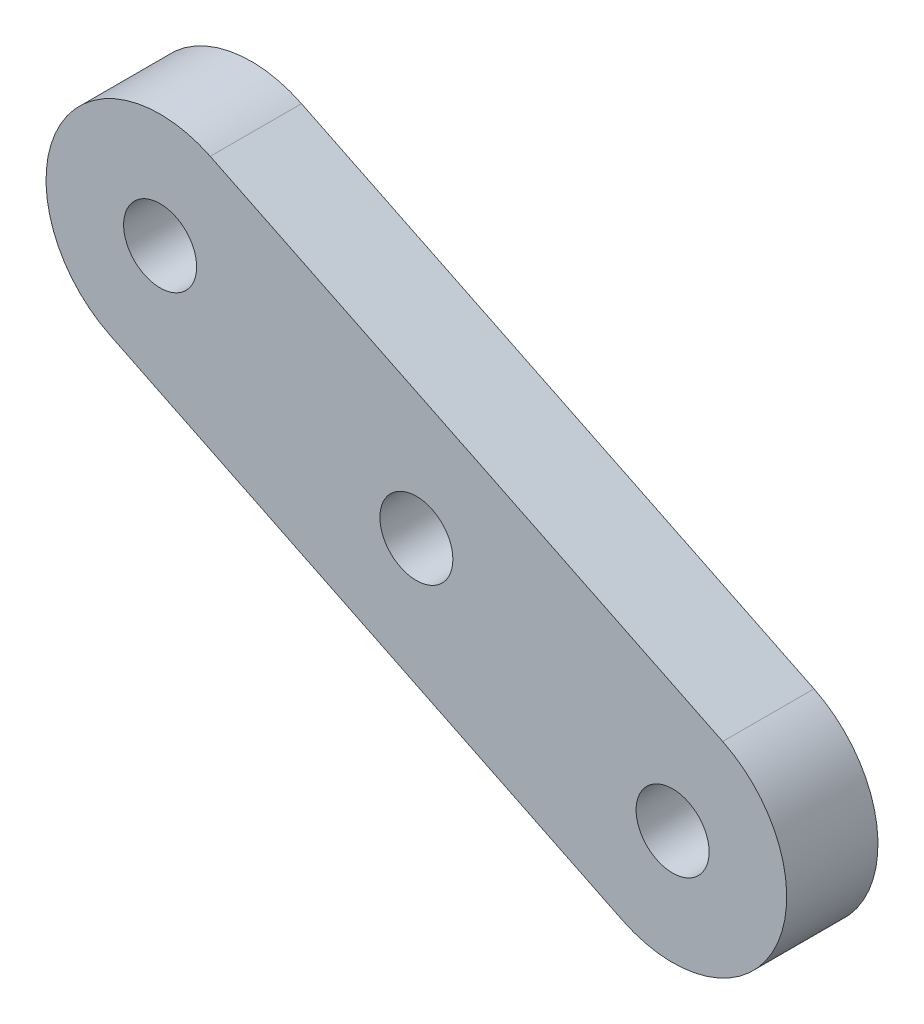
ISO-10303-21;
HEADER;
FILE_DESCRIPTION(('STEP AP214'),'2;1');
FILE_NAME('part.step','',(''),(''),'','','');
FILE_SCHEMA(('AUTOMOTIVE_DESIGN { 1 0 10303 214 1 1 1 1 }'));
ENDSEC;
DATA;
#1=APPLICATION_CONTEXT('core data for automotive mechanical design processes');
#2=APPLICATION_PROTOCOL_DEFINITION('international standard','automotive_design',2000,#1);
#3=PRODUCT_CONTEXT('',#1,'mechanical');
#4=PRODUCT('Part','Part','',(#3));
#5=PRODUCT_RELATED_PRODUCT_CATEGORY('part','',(#4));
#6=PRODUCT_DEFINITION_FORMATION('','',#4);
#7=PRODUCT_DEFINITION_CONTEXT('part definition',#1,'design');
#8=PRODUCT_DEFINITION('design','',#6,#7);
#9=PRODUCT_DEFINITION_SHAPE('','',#8);
#10=(LENGTH_UNIT() NAMED_UNIT(*) SI_UNIT(.MILLI.,.METRE.));
#11=(NAMED_UNIT(*) PLANE_ANGLE_UNIT() SI_UNIT($,.RADIAN.));
#12=(NAMED_UNIT(*) SI_UNIT($,.STERADIAN.) SOLID_ANGLE_UNIT());
#13=UNCERTAINTY_MEASURE_WITH_UNIT(LENGTH_MEASURE(1.E-05),#10,'distance_accuracy_value','');
#14=(GEOMETRIC_REPRESENTATION_CONTEXT(3) GLOBAL_UNCERTAINTY_ASSIGNED_CONTEXT((#13)) GLOBAL_UNIT_ASSIGNED_CONTEXT((#10,
#11,#12)) REPRESENTATION_CONTEXT('',''));
#15=CARTESIAN_POINT('',(0.,0.,0.));
#16=DIRECTION('',(0.,0.,1.));
#17=DIRECTION('',(1.,0.,0.));
#18=AXIS2_PLACEMENT_3D('',#15,#16,#17);
#19=CARTESIAN_POINT('',(0.,0.,4.));
#20=DIRECTION('',(0.,0.,1.));
#21=DIRECTION('',(1.,0.,0.));
#22=AXIS2_PLACEMENT_3D('',#19,#20,#21);
#23=PLANE('',#22);
#24=CARTESIAN_POINT('',(0.,0.,4.));
#25=DIRECTION('',(0.,0.,1.));
#26=DIRECTION('',(1.,0.,0.));
#27=AXIS2_PLACEMENT_3D('',#24,#25,#26);
#28=CIRCLE('',#27,1.6);
#29=CARTESIAN_POINT('',(1.60000000000001,0.,4.));
#30=VERTEX_POINT('',#29);
#31=EDGE_CURVE('E115',#30,#30,#28,.T.);
#32=ORIENTED_EDGE('',*,*,#31,.F.);
#33=EDGE_LOOP('',(#32));
#34=FACE_BOUND('',#33,.T.);
#35=CARTESIAN_POINT('',(0.,0.,4.));
#36=DIRECTION('',(0.,0.,1.));
#37=DIRECTION('',(1.,0.,0.));
#38=AXIS2_PLACEMENT_3D('',#35,#36,#37);
#39=CIRCLE('',#38,5.);
#40=CARTESIAN_POINT('',(-2.19568936266241,-4.4920984208598,4.));
#41=VERTEX_POINT('',#40);
#42=CARTESIAN_POINT('',(2.19568936266242,4.4920984208598,4.));
#43=VERTEX_POINT('',#42);
#44=EDGE_CURVE('E85',#41,#43,#39,.T.);
#45=ORIENTED_EDGE('',*,*,#44,.T.);
#46=DIRECTION('',(-0.898419684171961,0.439137872532482,0.));
#47=VECTOR('',#46,1.);
#48=CARTESIAN_POINT('',(2.19568936266242,4.4920984208598,4.));
#49=LINE('',#48,#47);
#50=CARTESIAN_POINT('',(-20.2648027416366,15.4705452341719,4.));
#51=VERTEX_POINT('',#50);
#52=EDGE_CURVE('E80',#43,#51,#49,.T.);
#53=ORIENTED_EDGE('',*,*,#52,.T.);
#54=CARTESIAN_POINT('',(-22.460492104299,10.9784468133121,4.));
#55=DIRECTION('',(0.,0.,1.));
#56=DIRECTION('',(1.,0.,0.));
#57=AXIS2_PLACEMENT_3D('',#54,#55,#56);
#58=CIRCLE('',#57,5.);
#59=CARTESIAN_POINT('',(-24.6561814669614,6.48634839245225,4.));
#60=VERTEX_POINT('',#59);
#61=EDGE_CURVE('E83',#51,#60,#58,.T.);
#62=ORIENTED_EDGE('',*,*,#61,.T.);
#63=DIRECTION('',(0.898419684171961,-0.439137872532482,0.));
#64=VECTOR('',#63,1.);
#65=CARTESIAN_POINT('',(-2.19568936266241,-4.4920984208598,4.));
#66=LINE('',#65,#64);
#67=EDGE_CURVE('E50',#60,#41,#66,.T.);
#68=ORIENTED_EDGE('',*,*,#67,.T.);
#69=EDGE_LOOP('',(#45,#53,#62,#68));
#70=FACE_BOUND('',#69,.T.);
#71=CARTESIAN_POINT('',(-22.460492104299,10.9784468133121,4.));
#72=DIRECTION('',(0.,0.,1.));
#73=DIRECTION('',(1.,0.,0.));
#74=AXIS2_PLACEMENT_3D('',#71,#72,#73);
#75=CIRCLE('',#74,1.6);
#76=CARTESIAN_POINT('',(-20.860492104299,10.9784468133121,4.));
#77=VERTEX_POINT('',#76);
#78=EDGE_CURVE('E100',#77,#77,#75,.T.);
#79=ORIENTED_EDGE('',*,*,#78,.F.);
#80=EDGE_LOOP('',(#79));
#81=FACE_BOUND('',#80,.T.);
#82=CARTESIAN_POINT('',(-11.2302460521495,5.48922340665603,4.));
#83=DIRECTION('',(0.,0.,1.));
#84=DIRECTION('',(1.,0.,0.));
#85=AXIS2_PLACEMENT_3D('',#82,#83,#84);
#86=CIRCLE('',#85,1.6);
#87=CARTESIAN_POINT('',(-9.63024605214951,5.48922340665603,4.));
#88=VERTEX_POINT('',#87);
#89=EDGE_CURVE('E121',#88,#88,#86,.T.);
#90=ORIENTED_EDGE('',*,*,#89,.F.);
#91=EDGE_LOOP('',(#90));
#92=FACE_BOUND('',#91,.T.);
#93=ADVANCED_FACE('F33',(#34,#70,#81,#92),#23,.T.);
#94=CARTESIAN_POINT('',(0.,0.,0.));
#95=DIRECTION('',(0.,0.,1.));
#96=DIRECTION('',(1.,0.,0.));
#97=AXIS2_PLACEMENT_3D('',#94,#95,#96);
#98=PLANE('',#97);
#99=CARTESIAN_POINT('',(0.,0.,0.));
#100=DIRECTION('',(0.,0.,1.));
#101=DIRECTION('',(1.,0.,0.));
#102=AXIS2_PLACEMENT_3D('',#99,#100,#101);
#103=CIRCLE('',#102,5.);
#104=CARTESIAN_POINT('',(-2.19568936266241,-4.4920984208598,0.));
#105=VERTEX_POINT('',#104);
#106=CARTESIAN_POINT('',(2.19568936266242,4.4920984208598,0.));
#107=VERTEX_POINT('',#106);
#108=EDGE_CURVE('E97',#105,#107,#103,.T.);
#109=ORIENTED_EDGE('',*,*,#108,.F.);
#110=DIRECTION('',(0.898419684171961,-0.439137872532482,0.));
#111=VECTOR('',#110,1.);
#112=CARTESIAN_POINT('',(-2.19568936266241,-4.4920984208598,0.));
#113=LINE('',#112,#111);
#114=CARTESIAN_POINT('',(-24.6561814669614,6.48634839245225,0.));
#115=VERTEX_POINT('',#114);
#116=EDGE_CURVE('E73',#115,#105,#113,.T.);
#117=ORIENTED_EDGE('',*,*,#116,.F.);
#118=CARTESIAN_POINT('',(-22.460492104299,10.9784468133121,0.));
#119=DIRECTION('',(0.,0.,1.));
#120=DIRECTION('',(1.,0.,0.));
#121=AXIS2_PLACEMENT_3D('',#118,#119,#120);
#122=CIRCLE('',#121,5.);
#123=CARTESIAN_POINT('',(-20.2648027416366,15.4705452341719,0.));
#124=VERTEX_POINT('',#123);
#125=EDGE_CURVE('E67',#124,#115,#122,.T.);
#126=ORIENTED_EDGE('',*,*,#125,.F.);
#127=DIRECTION('',(-0.898419684171961,0.439137872532482,0.));
#128=VECTOR('',#127,1.);
#129=CARTESIAN_POINT('',(2.19568936266242,4.4920984208598,0.));
#130=LINE('',#129,#128);
#131=EDGE_CURVE('E89',#107,#124,#130,.T.);
#132=ORIENTED_EDGE('',*,*,#131,.F.);
#133=EDGE_LOOP('',(#109,#117,#126,#132));
#134=FACE_BOUND('',#133,.T.);
#135=CARTESIAN_POINT('',(-22.460492104299,10.9784468133121,0.));
#136=DIRECTION('',(0.,0.,1.));
#137=DIRECTION('',(1.,0.,0.));
#138=AXIS2_PLACEMENT_3D('',#135,#136,#137);
#139=CIRCLE('',#138,1.6);
#140=CARTESIAN_POINT('',(-20.860492104299,10.9784468133121,0.));
#141=VERTEX_POINT('',#140);
#142=EDGE_CURVE('E112',#141,#141,#139,.T.);
#143=ORIENTED_EDGE('',*,*,#142,.T.);
#144=EDGE_LOOP('',(#143));
#145=FACE_BOUND('',#144,.T.);
#146=CARTESIAN_POINT('',(0.,0.,0.));
#147=DIRECTION('',(0.,0.,1.));
#148=DIRECTION('',(1.,0.,0.));
#149=AXIS2_PLACEMENT_3D('',#146,#147,#148);
#150=CIRCLE('',#149,1.6);
#151=CARTESIAN_POINT('',(1.60000000000001,0.,0.));
#152=VERTEX_POINT('',#151);
#153=EDGE_CURVE('E118',#152,#152,#150,.T.);
#154=ORIENTED_EDGE('',*,*,#153,.T.);
#155=EDGE_LOOP('',(#154));
#156=FACE_BOUND('',#155,.T.);
#157=CARTESIAN_POINT('',(-11.2302460521495,5.48922340665603,0.));
#158=DIRECTION('',(0.,0.,1.));
#159=DIRECTION('',(1.,0.,0.));
#160=AXIS2_PLACEMENT_3D('',#157,#158,#159);
#161=CIRCLE('',#160,1.6);
#162=CARTESIAN_POINT('',(-9.63024605214951,5.48922340665603,0.));
#163=VERTEX_POINT('',#162);
#164=EDGE_CURVE('E124',#163,#163,#161,.T.);
#165=ORIENTED_EDGE('',*,*,#164,.T.);
#166=EDGE_LOOP('',(#165));
#167=FACE_BOUND('',#166,.T.);
#168=ADVANCED_FACE('F108',(#134,#145,#156,#167),#98,.F.);
#169=CARTESIAN_POINT('',(0.,0.,4.));
#170=DIRECTION('',(0.,0.,-1.));
#171=DIRECTION('',(-1.,0.,0.));
#172=AXIS2_PLACEMENT_3D('',#169,#170,#171);
#173=CYLINDRICAL_SURFACE('',#172,5.);
#174=ORIENTED_EDGE('',*,*,#108,.T.);
#175=DIRECTION('',(0.,0.,-1.));
#176=VECTOR('',#175,1.);
#177=CARTESIAN_POINT('',(2.19568936266242,4.4920984208598,4.));
#178=LINE('',#177,#176);
#179=EDGE_CURVE('E11',#43,#107,#178,.T.);
#180=ORIENTED_EDGE('',*,*,#179,.F.);
#181=ORIENTED_EDGE('',*,*,#44,.F.);
#182=DIRECTION('',(0.,0.,-1.));
#183=VECTOR('',#182,1.);
#184=CARTESIAN_POINT('',(-2.19568936266241,-4.4920984208598,4.));
#185=LINE('',#184,#183);
#186=EDGE_CURVE('E93',#41,#105,#185,.T.);
#187=ORIENTED_EDGE('',*,*,#186,.T.);
#188=EDGE_LOOP('',(#174,#180,#181,#187));
#189=FACE_BOUND('',#188,.T.);
#190=ADVANCED_FACE('F35',(#189),#173,.T.);
#191=CARTESIAN_POINT('',(2.19568936266242,4.4920984208598,4.));
#192=DIRECTION('',(-0.439137872532482,-0.898419684171961,0.));
#193=DIRECTION('',(0.898419684171961,-0.439137872532482,0.));
#194=AXIS2_PLACEMENT_3D('',#191,#192,#193);
#195=PLANE('',#194);
#196=ORIENTED_EDGE('',*,*,#131,.T.);
#197=DIRECTION('',(0.,0.,-1.));
#198=VECTOR('',#197,1.);
#199=CARTESIAN_POINT('',(-20.2648027416366,15.4705452341719,4.));
#200=LINE('',#199,#198);
#201=EDGE_CURVE('E42',#51,#124,#200,.T.);
#202=ORIENTED_EDGE('',*,*,#201,.F.);
#203=ORIENTED_EDGE('',*,*,#52,.F.);
#204=ORIENTED_EDGE('',*,*,#179,.T.);
#205=EDGE_LOOP('',(#196,#202,#203,#204));
#206=FACE_BOUND('',#205,.T.);
#207=ADVANCED_FACE('F88',(#206),#195,.F.);
#208=CARTESIAN_POINT('',(-22.460492104299,10.9784468133121,4.));
#209=DIRECTION('',(0.,0.,-1.));
#210=DIRECTION('',(-1.,0.,0.));
#211=AXIS2_PLACEMENT_3D('',#208,#209,#210);
#212=CYLINDRICAL_SURFACE('',#211,5.);
#213=ORIENTED_EDGE('',*,*,#125,.T.);
#214=DIRECTION('',(0.,0.,-1.));
#215=VECTOR('',#214,1.);
#216=CARTESIAN_POINT('',(-24.6561814669614,6.48634839245225,4.));
#217=LINE('',#216,#215);
#218=EDGE_CURVE('E90',#60,#115,#217,.T.);
#219=ORIENTED_EDGE('',*,*,#218,.F.);
#220=ORIENTED_EDGE('',*,*,#61,.F.);
#221=ORIENTED_EDGE('',*,*,#201,.T.);
#222=EDGE_LOOP('',(#213,#219,#220,#221));
#223=FACE_BOUND('',#222,.T.);
#224=ADVANCED_FACE('F91',(#223),#212,.T.);
#225=CARTESIAN_POINT('',(-2.19568936266241,-4.4920984208598,4.));
#226=DIRECTION('',(0.439137872532482,0.898419684171961,0.));
#227=DIRECTION('',(-0.898419684171961,0.439137872532482,0.));
#228=AXIS2_PLACEMENT_3D('',#225,#226,#227);
#229=PLANE('',#228);
#230=ORIENTED_EDGE('',*,*,#116,.T.);
#231=ORIENTED_EDGE('',*,*,#186,.F.);
#232=ORIENTED_EDGE('',*,*,#67,.F.);
#233=ORIENTED_EDGE('',*,*,#218,.T.);
#234=EDGE_LOOP('',(#230,#231,#232,#233));
#235=FACE_BOUND('',#234,.T.);
#236=ADVANCED_FACE('F105',(#235),#229,.F.);
#237=CARTESIAN_POINT('',(-22.460492104299,10.9784468133121,4.));
#238=DIRECTION('',(0.,0.,-1.));
#239=DIRECTION('',(-1.,0.,0.));
#240=AXIS2_PLACEMENT_3D('',#237,#238,#239);
#241=CYLINDRICAL_SURFACE('',#240,1.6);
#242=ORIENTED_EDGE('',*,*,#78,.T.);
#243=EDGE_LOOP('',(#242));
#244=FACE_BOUND('',#243,.T.);
#245=ORIENTED_EDGE('',*,*,#142,.F.);
#246=EDGE_LOOP('',(#245));
#247=FACE_BOUND('',#246,.T.);
#248=ADVANCED_FACE('F142',(#244,#247),#241,.F.);
#249=CARTESIAN_POINT('',(0.,0.,4.));
#250=DIRECTION('',(0.,0.,-1.));
#251=DIRECTION('',(-1.,0.,0.));
#252=AXIS2_PLACEMENT_3D('',#249,#250,#251);
#253=CYLINDRICAL_SURFACE('',#252,1.6);
#254=ORIENTED_EDGE('',*,*,#31,.T.);
#255=EDGE_LOOP('',(#254));
#256=FACE_BOUND('',#255,.T.);
#257=ORIENTED_EDGE('',*,*,#153,.F.);
#258=EDGE_LOOP('',(#257));
#259=FACE_BOUND('',#258,.T.);
#260=ADVANCED_FACE('F188',(#256,#259),#253,.F.);
#261=CARTESIAN_POINT('',(-11.2302460521495,5.48922340665603,4.));
#262=DIRECTION('',(0.,0.,-1.));
#263=DIRECTION('',(-1.,0.,0.));
#264=AXIS2_PLACEMENT_3D('',#261,#262,#263);
#265=CYLINDRICAL_SURFACE('',#264,1.6);
#266=ORIENTED_EDGE('',*,*,#89,.T.);
#267=EDGE_LOOP('',(#266));
#268=FACE_BOUND('',#267,.T.);
#269=ORIENTED_EDGE('',*,*,#164,.F.);
#270=EDGE_LOOP('',(#269));
#271=FACE_BOUND('',#270,.T.);
#272=ADVANCED_FACE('F130',(#268,#271),#265,.F.);
#273=CLOSED_SHELL('',(#93,#168,#190,#207,#224,#236,#248,#260,#272));
#274=MANIFOLD_SOLID_BREP('B2',#273);
#275=ADVANCED_BREP_SHAPE_REPRESENTATION('',(#18,#274),#14);
#276=SHAPE_DEFINITION_REPRESENTATION(#9,#275);
ENDSEC;
END-ISO-10303-21;
